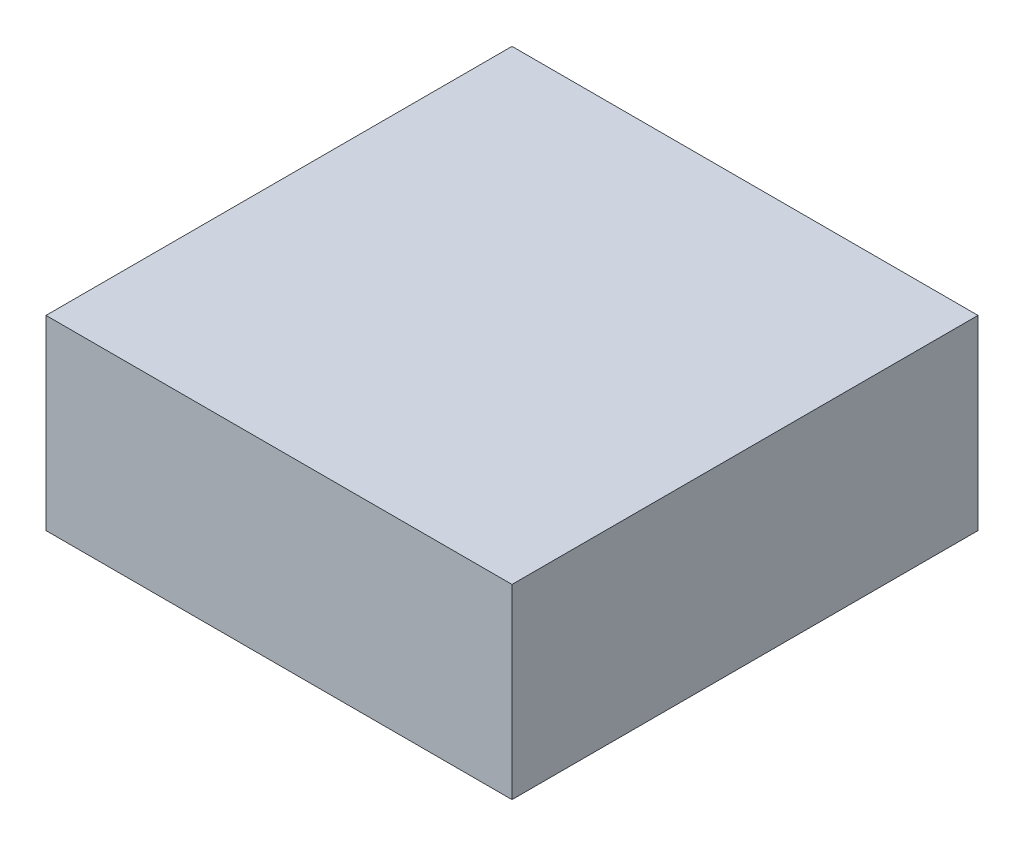
ISO-10303-21;
HEADER;
FILE_DESCRIPTION(('STEP AP214'),'2;1');
FILE_NAME('part.step','',(''),(''),'','','');
FILE_SCHEMA(('AUTOMOTIVE_DESIGN { 1 0 10303 214 1 1 1 1 }'));
ENDSEC;
DATA;
#1=APPLICATION_CONTEXT('core data for automotive mechanical design processes');
#2=APPLICATION_PROTOCOL_DEFINITION('international standard','automotive_design',2000,#1);
#3=PRODUCT_CONTEXT('',#1,'mechanical');
#4=PRODUCT('Part','Part','',(#3));
#5=PRODUCT_RELATED_PRODUCT_CATEGORY('part','',(#4));
#6=PRODUCT_DEFINITION_FORMATION('','',#4);
#7=PRODUCT_DEFINITION_CONTEXT('part definition',#1,'design');
#8=PRODUCT_DEFINITION('design','',#6,#7);
#9=PRODUCT_DEFINITION_SHAPE('','',#8);
#10=(LENGTH_UNIT() NAMED_UNIT(*) SI_UNIT(.MILLI.,.METRE.));
#11=(NAMED_UNIT(*) PLANE_ANGLE_UNIT() SI_UNIT($,.RADIAN.));
#12=(NAMED_UNIT(*) SI_UNIT($,.STERADIAN.) SOLID_ANGLE_UNIT());
#13=UNCERTAINTY_MEASURE_WITH_UNIT(LENGTH_MEASURE(1.E-05),#10,'distance_accuracy_value','');
#14=(GEOMETRIC_REPRESENTATION_CONTEXT(3) GLOBAL_UNCERTAINTY_ASSIGNED_CONTEXT((#13)) GLOBAL_UNIT_ASSIGNED_CONTEXT((#10,
#11,#12)) REPRESENTATION_CONTEXT('',''));
#15=CARTESIAN_POINT('',(0.,0.,0.));
#16=DIRECTION('',(0.,0.,1.));
#17=DIRECTION('',(1.,0.,0.));
#18=AXIS2_PLACEMENT_3D('',#15,#16,#17);
#19=CARTESIAN_POINT('',(-0.219014600801289,0.65,-0.125));
#20=DIRECTION('',(0.,0.,1.));
#21=DIRECTION('',(1.,0.,0.));
#22=AXIS2_PLACEMENT_3D('',#19,#20,#21);
#23=PLANE('',#22);
#24=DIRECTION('',(-1.,0.,0.));
#25=VECTOR('',#24,1.);
#26=CARTESIAN_POINT('',(-0.219014600801289,0.55,-0.125));
#27=LINE('',#26,#25);
#28=CARTESIAN_POINT('',(-0.219014600801289,0.55,-0.125));
#29=VERTEX_POINT('',#28);
#30=CARTESIAN_POINT('',(-0.469014600801289,0.55,-0.125));
#31=VERTEX_POINT('',#30);
#32=EDGE_CURVE('E11',#29,#31,#27,.T.);
#33=ORIENTED_EDGE('',*,*,#32,.T.);
#34=DIRECTION('',(0.,-1.,0.));
#35=VECTOR('',#34,1.);
#36=CARTESIAN_POINT('',(-0.469014600801289,0.65,-0.125));
#37=LINE('',#36,#35);
#38=CARTESIAN_POINT('',(-0.469014600801289,0.65,-0.125));
#39=VERTEX_POINT('',#38);
#40=EDGE_CURVE('E24',#39,#31,#37,.T.);
#41=ORIENTED_EDGE('',*,*,#40,.F.);
#42=DIRECTION('',(-1.,0.,0.));
#43=VECTOR('',#42,1.);
#44=CARTESIAN_POINT('',(-0.219014600801289,0.65,-0.125));
#45=LINE('',#44,#43);
#46=CARTESIAN_POINT('',(-0.219014600801289,0.65,-0.125));
#47=VERTEX_POINT('',#46);
#48=EDGE_CURVE('E88',#47,#39,#45,.T.);
#49=ORIENTED_EDGE('',*,*,#48,.F.);
#50=DIRECTION('',(0.,-1.,0.));
#51=VECTOR('',#50,1.);
#52=CARTESIAN_POINT('',(-0.219014600801289,0.65,-0.125));
#53=LINE('',#52,#51);
#54=EDGE_CURVE('E77',#47,#29,#53,.T.);
#55=ORIENTED_EDGE('',*,*,#54,.T.);
#56=EDGE_LOOP('',(#33,#41,#49,#55));
#57=FACE_BOUND('',#56,.T.);
#58=ADVANCED_FACE('F17',(#57),#23,.F.);
#59=CARTESIAN_POINT('',(-0.469014600801289,0.65,-0.125));
#60=DIRECTION('',(1.,0.,0.));
#61=DIRECTION('',(0.,0.,-1.));
#62=AXIS2_PLACEMENT_3D('',#59,#60,#61);
#63=PLANE('',#62);
#64=DIRECTION('',(0.,0.,1.));
#65=VECTOR('',#64,1.);
#66=CARTESIAN_POINT('',(-0.469014600801289,0.55,-0.125));
#67=LINE('',#66,#65);
#68=CARTESIAN_POINT('',(-0.469014600801289,0.55,0.125));
#69=VERTEX_POINT('',#68);
#70=EDGE_CURVE('E85',#31,#69,#67,.T.);
#71=ORIENTED_EDGE('',*,*,#70,.T.);
#72=DIRECTION('',(0.,-1.,0.));
#73=VECTOR('',#72,1.);
#74=CARTESIAN_POINT('',(-0.469014600801289,0.65,0.125));
#75=LINE('',#74,#73);
#76=CARTESIAN_POINT('',(-0.469014600801289,0.65,0.125));
#77=VERTEX_POINT('',#76);
#78=EDGE_CURVE('E83',#77,#69,#75,.T.);
#79=ORIENTED_EDGE('',*,*,#78,.F.);
#80=DIRECTION('',(0.,0.,1.));
#81=VECTOR('',#80,1.);
#82=CARTESIAN_POINT('',(-0.469014600801289,0.65,-0.125));
#83=LINE('',#82,#81);
#84=EDGE_CURVE('E72',#39,#77,#83,.T.);
#85=ORIENTED_EDGE('',*,*,#84,.F.);
#86=ORIENTED_EDGE('',*,*,#40,.T.);
#87=EDGE_LOOP('',(#71,#79,#85,#86));
#88=FACE_BOUND('',#87,.T.);
#89=ADVANCED_FACE('F90',(#88),#63,.F.);
#90=CARTESIAN_POINT('',(-0.469014600801289,0.65,0.125));
#91=DIRECTION('',(0.,0.,-1.));
#92=DIRECTION('',(-1.,0.,0.));
#93=AXIS2_PLACEMENT_3D('',#90,#91,#92);
#94=PLANE('',#93);
#95=DIRECTION('',(1.,0.,0.));
#96=VECTOR('',#95,1.);
#97=CARTESIAN_POINT('',(-0.469014600801289,0.55,0.125));
#98=LINE('',#97,#96);
#99=CARTESIAN_POINT('',(-0.219014600801289,0.55,0.125));
#100=VERTEX_POINT('',#99);
#101=EDGE_CURVE('E60',#69,#100,#98,.T.);
#102=ORIENTED_EDGE('',*,*,#101,.T.);
#103=DIRECTION('',(0.,-1.,0.));
#104=VECTOR('',#103,1.);
#105=CARTESIAN_POINT('',(-0.219014600801289,0.65,0.125));
#106=LINE('',#105,#104);
#107=CARTESIAN_POINT('',(-0.219014600801289,0.65,0.125));
#108=VERTEX_POINT('',#107);
#109=EDGE_CURVE('E54',#108,#100,#106,.T.);
#110=ORIENTED_EDGE('',*,*,#109,.F.);
#111=DIRECTION('',(1.,0.,0.));
#112=VECTOR('',#111,1.);
#113=CARTESIAN_POINT('',(-0.469014600801289,0.65,0.125));
#114=LINE('',#113,#112);
#115=EDGE_CURVE('E58',#77,#108,#114,.T.);
#116=ORIENTED_EDGE('',*,*,#115,.F.);
#117=ORIENTED_EDGE('',*,*,#78,.T.);
#118=EDGE_LOOP('',(#102,#110,#116,#117));
#119=FACE_BOUND('',#118,.T.);
#120=ADVANCED_FACE('F56',(#119),#94,.F.);
#121=CARTESIAN_POINT('',(-0.219014600801289,0.65,0.125));
#122=DIRECTION('',(-1.,0.,0.));
#123=DIRECTION('',(0.,0.,1.));
#124=AXIS2_PLACEMENT_3D('',#121,#122,#123);
#125=PLANE('',#124);
#126=DIRECTION('',(0.,0.,-1.));
#127=VECTOR('',#126,1.);
#128=CARTESIAN_POINT('',(-0.219014600801289,0.55,0.125));
#129=LINE('',#128,#127);
#130=EDGE_CURVE('E73',#100,#29,#129,.T.);
#131=ORIENTED_EDGE('',*,*,#130,.T.);
#132=ORIENTED_EDGE('',*,*,#54,.F.);
#133=DIRECTION('',(0.,0.,-1.));
#134=VECTOR('',#133,1.);
#135=CARTESIAN_POINT('',(-0.219014600801289,0.65,0.125));
#136=LINE('',#135,#134);
#137=EDGE_CURVE('E70',#108,#47,#136,.T.);
#138=ORIENTED_EDGE('',*,*,#137,.F.);
#139=ORIENTED_EDGE('',*,*,#109,.T.);
#140=EDGE_LOOP('',(#131,#132,#138,#139));
#141=FACE_BOUND('',#140,.T.);
#142=ADVANCED_FACE('F76',(#141),#125,.F.);
#143=CARTESIAN_POINT('',(0.,0.65,0.));
#144=DIRECTION('',(0.,1.,0.));
#145=DIRECTION('',(0.,0.,1.));
#146=AXIS2_PLACEMENT_3D('',#143,#144,#145);
#147=PLANE('',#146);
#148=ORIENTED_EDGE('',*,*,#48,.T.);
#149=ORIENTED_EDGE('',*,*,#84,.T.);
#150=ORIENTED_EDGE('',*,*,#115,.T.);
#151=ORIENTED_EDGE('',*,*,#137,.T.);
#152=EDGE_LOOP('',(#148,#149,#150,#151));
#153=FACE_BOUND('',#152,.T.);
#154=ADVANCED_FACE('F69',(#153),#147,.T.);
#155=CARTESIAN_POINT('',(0.,0.55,0.));
#156=DIRECTION('',(0.,1.,0.));
#157=DIRECTION('',(0.,0.,1.));
#158=AXIS2_PLACEMENT_3D('',#155,#156,#157);
#159=PLANE('',#158);
#160=ORIENTED_EDGE('',*,*,#32,.F.);
#161=ORIENTED_EDGE('',*,*,#130,.F.);
#162=ORIENTED_EDGE('',*,*,#101,.F.);
#163=ORIENTED_EDGE('',*,*,#70,.F.);
#164=EDGE_LOOP('',(#160,#161,#162,#163));
#165=FACE_BOUND('',#164,.T.);
#166=ADVANCED_FACE('F91',(#165),#159,.F.);
#167=CLOSED_SHELL('',(#58,#89,#120,#142,#154,#166));
#168=MANIFOLD_SOLID_BREP('B1',#167);
#169=ADVANCED_BREP_SHAPE_REPRESENTATION('',(#18,#168),#14);
#170=SHAPE_DEFINITION_REPRESENTATION(#9,#169);
ENDSEC;
END-ISO-10303-21;
